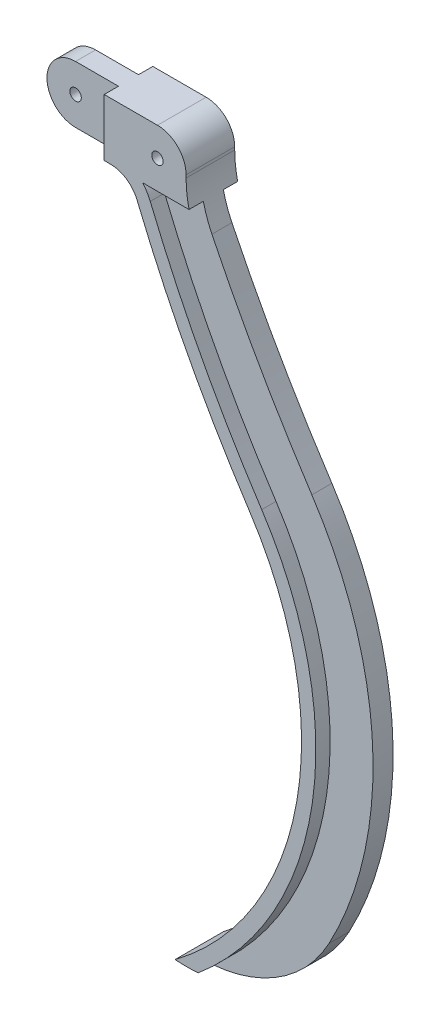
ISO-10303-21;
HEADER;
FILE_DESCRIPTION(('STEP AP214'),'2;1');
FILE_NAME('part.step','',(''),(''),'','','');
FILE_SCHEMA(('AUTOMOTIVE_DESIGN { 1 0 10303 214 1 1 1 1 }'));
ENDSEC;
DATA;
#1=APPLICATION_CONTEXT('core data for automotive mechanical design processes');
#2=APPLICATION_PROTOCOL_DEFINITION('international standard','automotive_design',2000,#1);
#3=PRODUCT_CONTEXT('',#1,'mechanical');
#4=PRODUCT('Part','Part','',(#3));
#5=PRODUCT_RELATED_PRODUCT_CATEGORY('part','',(#4));
#6=PRODUCT_DEFINITION_FORMATION('','',#4);
#7=PRODUCT_DEFINITION_CONTEXT('part definition',#1,'design');
#8=PRODUCT_DEFINITION('design','',#6,#7);
#9=PRODUCT_DEFINITION_SHAPE('','',#8);
#10=(LENGTH_UNIT() NAMED_UNIT(*) SI_UNIT(.MILLI.,.METRE.));
#11=(NAMED_UNIT(*) PLANE_ANGLE_UNIT() SI_UNIT($,.RADIAN.));
#12=(NAMED_UNIT(*) SI_UNIT($,.STERADIAN.) SOLID_ANGLE_UNIT());
#13=UNCERTAINTY_MEASURE_WITH_UNIT(LENGTH_MEASURE(1.E-05),#10,'distance_accuracy_value','');
#14=(GEOMETRIC_REPRESENTATION_CONTEXT(3) GLOBAL_UNCERTAINTY_ASSIGNED_CONTEXT((#13)) GLOBAL_UNIT_ASSIGNED_CONTEXT((#10,
#11,#12)) REPRESENTATION_CONTEXT('',''));
#15=CARTESIAN_POINT('',(0.,0.,0.));
#16=DIRECTION('',(0.,0.,1.));
#17=DIRECTION('',(1.,0.,0.));
#18=AXIS2_PLACEMENT_3D('',#15,#16,#17);
#19=CARTESIAN_POINT('',(26.0064078419205,151.361306160566,-8.));
#20=DIRECTION('',(0.,0.,1.));
#21=DIRECTION('',(1.,0.,0.));
#22=AXIS2_PLACEMENT_3D('',#19,#20,#21);
#23=CYLINDRICAL_SURFACE('',#22,9.99999999999999);
#24=DIRECTION('',(0.,0.,1.));
#25=VECTOR('',#24,1.);
#26=CARTESIAN_POINT('',(26.0064078419205,161.361306160566,-8.));
#27=LINE('',#26,#25);
#28=CARTESIAN_POINT('',(26.0064078419205,161.361306160566,0.));
#29=VERTEX_POINT('',#28);
#30=CARTESIAN_POINT('',(26.0064078419205,161.361306160566,7.));
#31=VERTEX_POINT('',#30);
#32=EDGE_CURVE('E62',#29,#31,#27,.T.);
#33=ORIENTED_EDGE('',*,*,#32,.F.);
#34=CARTESIAN_POINT('',(26.0064078419205,151.361306160566,0.));
#35=DIRECTION('',(0.,0.,-1.));
#36=DIRECTION('',(-1.,0.,0.));
#37=AXIS2_PLACEMENT_3D('',#34,#35,#36);
#38=CIRCLE('',#37,9.99999999999999);
#39=CARTESIAN_POINT('',(26.0064078419205,141.361306160566,0.));
#40=VERTEX_POINT('',#39);
#41=EDGE_CURVE('E214',#40,#29,#38,.T.);
#42=ORIENTED_EDGE('',*,*,#41,.F.);
#43=DIRECTION('',(0.,0.,1.));
#44=VECTOR('',#43,1.);
#45=CARTESIAN_POINT('',(26.0064078419205,141.361306160517,-8.));
#46=LINE('',#45,#44);
#47=CARTESIAN_POINT('',(26.0064078419205,141.361306160517,7.));
#48=VERTEX_POINT('',#47);
#49=EDGE_CURVE('E231',#40,#48,#46,.T.);
#50=ORIENTED_EDGE('',*,*,#49,.T.);
#51=CARTESIAN_POINT('',(26.0064078419205,151.361306160566,7.));
#52=DIRECTION('',(0.,0.,1.));
#53=DIRECTION('',(1.,0.,0.));
#54=AXIS2_PLACEMENT_3D('',#51,#52,#53);
#55=CIRCLE('',#54,9.99999999999999);
#56=EDGE_CURVE('E230',#31,#48,#55,.T.);
#57=ORIENTED_EDGE('',*,*,#56,.F.);
#58=EDGE_LOOP('',(#33,#42,#50,#57));
#59=FACE_BOUND('',#58,.T.);
#60=ADVANCED_FACE('F36',(#59),#23,.T.);
#61=CARTESIAN_POINT('',(0.,141.361306160566,-5.));
#62=DIRECTION('',(0.,1.,0.));
#63=DIRECTION('',(-1.,0.,0.));
#64=AXIS2_PLACEMENT_3D('',#61,#62,#63);
#65=PLANE('',#64);
#66=DIRECTION('',(-1.,0.,0.));
#67=VECTOR('',#66,1.);
#68=CARTESIAN_POINT('',(0.,141.361306160566,0.));
#69=LINE('',#68,#67);
#70=CARTESIAN_POINT('',(41.0064078419205,141.361306160566,0.));
#71=VERTEX_POINT('',#70);
#72=EDGE_CURVE('E219',#71,#40,#69,.T.);
#73=ORIENTED_EDGE('',*,*,#72,.F.);
#74=DIRECTION('',(0.,0.,-1.));
#75=VECTOR('',#74,1.);
#76=CARTESIAN_POINT('',(41.0064078419205,141.361306160566,0.));
#77=LINE('',#76,#75);
#78=CARTESIAN_POINT('',(41.0064078419205,141.361306160566,-5.));
#79=VERTEX_POINT('',#78);
#80=EDGE_CURVE('E463',#71,#79,#77,.T.);
#81=ORIENTED_EDGE('',*,*,#80,.T.);
#82=DIRECTION('',(-1.,0.,0.));
#83=VECTOR('',#82,1.);
#84=CARTESIAN_POINT('',(54.4167674366087,141.361306160566,-5.));
#85=LINE('',#84,#83);
#86=CARTESIAN_POINT('',(43.2364275491099,141.361306160566,-5.));
#87=VERTEX_POINT('',#86);
#88=EDGE_CURVE('E474',#87,#79,#85,.T.);
#89=ORIENTED_EDGE('',*,*,#88,.F.);
#90=DIRECTION('',(0.,0.,1.));
#91=VECTOR('',#90,1.);
#92=CARTESIAN_POINT('',(43.2364275491099,141.361306160566,-5.));
#93=LINE('',#92,#91);
#94=CARTESIAN_POINT('',(43.23642754911,141.361306160566,12.));
#95=VERTEX_POINT('',#94);
#96=EDGE_CURVE('E402',#87,#95,#93,.T.);
#97=ORIENTED_EDGE('',*,*,#96,.T.);
#98=DIRECTION('',(1.,1.09654838696025E-12,0.));
#99=VECTOR('',#98,1.);
#100=CARTESIAN_POINT('',(54.4167674366248,141.361306160549,12.));
#101=LINE('',#100,#99);
#102=CARTESIAN_POINT('',(41.0064078419205,141.361306160534,12.));
#103=VERTEX_POINT('',#102);
#104=EDGE_CURVE('E247',#103,#95,#101,.T.);
#105=ORIENTED_EDGE('',*,*,#104,.F.);
#106=DIRECTION('',(0.,0.,1.));
#107=VECTOR('',#106,1.);
#108=CARTESIAN_POINT('',(41.0064078419205,141.361306160534,7.));
#109=LINE('',#108,#107);
#110=CARTESIAN_POINT('',(41.0064078419205,141.361306160534,7.));
#111=VERTEX_POINT('',#110);
#112=EDGE_CURVE('E237',#111,#103,#109,.T.);
#113=ORIENTED_EDGE('',*,*,#112,.F.);
#114=DIRECTION('',(1.,1.09654838696025E-12,0.));
#115=VECTOR('',#114,1.);
#116=CARTESIAN_POINT('',(-1.55009512248878E-10,141.361306160489,7.));
#117=LINE('',#116,#115);
#118=EDGE_CURVE('E515',#48,#111,#117,.T.);
#119=ORIENTED_EDGE('',*,*,#118,.F.);
#120=ORIENTED_EDGE('',*,*,#49,.F.);
#121=EDGE_LOOP('',(#73,#81,#89,#97,#105,#113,#119,#120));
#122=FACE_BOUND('',#121,.T.);
#123=ADVANCED_FACE('F467',(#122),#65,.F.);
#124=CARTESIAN_POINT('',(0.,0.,12.));
#125=DIRECTION('',(0.,0.,1.));
#126=DIRECTION('',(1.,0.,0.));
#127=AXIS2_PLACEMENT_3D('',#124,#125,#126);
#128=PLANE('',#127);
#129=CARTESIAN_POINT('',(59.639031753599,151.361306160566,12.));
#130=DIRECTION('',(0.,0.,1.));
#131=DIRECTION('',(1.,0.,0.));
#132=AXIS2_PLACEMENT_3D('',#129,#130,#131);
#133=CIRCLE('',#132,2.);
#134=CARTESIAN_POINT('',(61.639031753599,151.361306160566,12.));
#135=VERTEX_POINT('',#134);
#136=EDGE_CURVE('E243',#135,#135,#133,.T.);
#137=ORIENTED_EDGE('',*,*,#136,.F.);
#138=EDGE_LOOP('',(#137));
#139=FACE_BOUND('',#138,.T.);
#140=DIRECTION('',(-1.,0.,0.));
#141=VECTOR('',#140,1.);
#142=CARTESIAN_POINT('',(0.,161.361306160566,12.));
#143=LINE('',#142,#141);
#144=CARTESIAN_POINT('',(59.639031753599,161.361306160566,12.));
#145=VERTEX_POINT('',#144);
#146=CARTESIAN_POINT('',(41.0064078419205,161.361306160566,12.));
#147=VERTEX_POINT('',#146);
#148=EDGE_CURVE('E259',#145,#147,#143,.T.);
#149=ORIENTED_EDGE('',*,*,#148,.T.);
#150=DIRECTION('',(0.,-1.,0.));
#151=VECTOR('',#150,1.);
#152=CARTESIAN_POINT('',(41.0064078419205,0.,12.));
#153=LINE('',#152,#151);
#154=EDGE_CURVE('E459',#147,#103,#153,.T.);
#155=ORIENTED_EDGE('',*,*,#154,.T.);
#156=ORIENTED_EDGE('',*,*,#104,.T.);
#157=CARTESIAN_POINT('',(43.23642754911,131.361306160566,12.));
#158=DIRECTION('',(0.,0.,1.));
#159=DIRECTION('',(1.,0.,0.));
#160=AXIS2_PLACEMENT_3D('',#157,#158,#159);
#161=CIRCLE('',#160,10.);
#162=CARTESIAN_POINT('',(52.4892579193839,135.154079570479,12.));
#163=VERTEX_POINT('',#162);
#164=EDGE_CURVE('E275',#95,#163,#161,.F.);
#165=ORIENTED_EDGE('',*,*,#164,.T.);
#166=CARTESIAN_POINT('',(458.278922904363,301.488940340937,12.));
#167=DIRECTION('',(0.,0.,1.));
#168=DIRECTION('',(1.,0.,0.));
#169=AXIS2_PLACEMENT_3D('',#166,#167,#168);
#170=CIRCLE('',#169,438.557337318793);
#171=CARTESIAN_POINT('',(91.8968320902866,60.4563665114739,12.));
#172=VERTEX_POINT('',#171);
#173=EDGE_CURVE('E278',#163,#172,#170,.T.);
#174=ORIENTED_EDGE('',*,*,#173,.T.);
#175=CARTESIAN_POINT('',(0.,0.,12.));
#176=DIRECTION('',(0.,0.,1.));
#177=DIRECTION('',(1.,0.,0.));
#178=AXIS2_PLACEMENT_3D('',#175,#176,#177);
#179=CIRCLE('',#178,110.);
#180=CARTESIAN_POINT('',(65.7870063524313,-88.1593432098104,12.));
#181=VERTEX_POINT('',#180);
#182=EDGE_CURVE('E281',#172,#181,#179,.F.);
#183=ORIENTED_EDGE('',*,*,#182,.T.);
#184=CARTESIAN_POINT('',(69.639031753599,-37.3081513309394,12.));
#185=DIRECTION('',(0.,0.,1.));
#186=DIRECTION('',(1.,0.,0.));
#187=AXIS2_PLACEMENT_3D('',#184,#185,#186);
#188=CIRCLE('',#187,50.9968804456998);
#189=CARTESIAN_POINT('',(73.8810042167599,-88.1282997448784,12.));
#190=VERTEX_POINT('',#189);
#191=EDGE_CURVE('E284',#181,#190,#188,.T.);
#192=ORIENTED_EDGE('',*,*,#191,.T.);
#193=CARTESIAN_POINT('',(0.,0.,12.));
#194=DIRECTION('',(0.,0.,1.));
#195=DIRECTION('',(1.,0.,0.));
#196=AXIS2_PLACEMENT_3D('',#193,#194,#195);
#197=CIRCLE('',#196,115.);
#198=CARTESIAN_POINT('',(96.0739608216634,63.2043831710868,12.));
#199=VERTEX_POINT('',#198);
#200=EDGE_CURVE('E286',#190,#199,#197,.T.);
#201=ORIENTED_EDGE('',*,*,#200,.T.);
#202=CARTESIAN_POINT('',(458.278922904363,301.488940340937,12.));
#203=DIRECTION('',(0.,0.,1.));
#204=DIRECTION('',(1.,0.,0.));
#205=AXIS2_PLACEMENT_3D('',#202,#203,#204);
#206=CIRCLE('',#205,433.557337318793);
#207=CARTESIAN_POINT('',(57.1156731045208,137.050466275435,12.));
#208=VERTEX_POINT('',#207);
#209=EDGE_CURVE('E268',#208,#199,#206,.T.);
#210=ORIENTED_EDGE('',*,*,#209,.F.);
#211=CARTESIAN_POINT('',(43.23642754911,131.361306160566,12.));
#212=DIRECTION('',(0.,0.,1.));
#213=DIRECTION('',(1.,0.,0.));
#214=AXIS2_PLACEMENT_3D('',#211,#212,#213);
#215=CIRCLE('',#214,15.);
#216=CARTESIAN_POINT('',(54.4167674366248,141.361306160549,12.));
#217=VERTEX_POINT('',#216);
#218=EDGE_CURVE('E271',#208,#217,#215,.T.);
#219=ORIENTED_EDGE('',*,*,#218,.T.);
#220=CARTESIAN_POINT('',(70.6669208791283,141.361306160566,12.));
#221=VERTEX_POINT('',#220);
#222=EDGE_CURVE('E250',#217,#221,#101,.T.);
#223=ORIENTED_EDGE('',*,*,#222,.T.);
#224=CARTESIAN_POINT('',(109.639031753603,150.370999495412,12.));
#225=DIRECTION('',(0.,0.,-1.));
#226=DIRECTION('',(-1.,0.,0.));
#227=AXIS2_PLACEMENT_3D('',#224,#225,#226);
#228=CIRCLE('',#227,40.0000000000042);
#229=CARTESIAN_POINT('',(69.639031753599,150.370999495412,12.));
#230=VERTEX_POINT('',#229);
#231=EDGE_CURVE('E249',#221,#230,#228,.T.);
#232=ORIENTED_EDGE('',*,*,#231,.T.);
#233=DIRECTION('',(0.,1.,0.));
#234=VECTOR('',#233,1.);
#235=CARTESIAN_POINT('',(69.639031753599,151.361306160566,12.));
#236=LINE('',#235,#234);
#237=CARTESIAN_POINT('',(69.639031753599,151.361306160566,12.));
#238=VERTEX_POINT('',#237);
#239=EDGE_CURVE('E253',#230,#238,#236,.T.);
#240=ORIENTED_EDGE('',*,*,#239,.T.);
#241=CARTESIAN_POINT('',(59.639031753599,151.361306160566,12.));
#242=DIRECTION('',(0.,0.,1.));
#243=DIRECTION('',(-1.,0.,0.));
#244=AXIS2_PLACEMENT_3D('',#241,#242,#243);
#245=CIRCLE('',#244,10.);
#246=EDGE_CURVE('E256',#238,#145,#245,.T.);
#247=ORIENTED_EDGE('',*,*,#246,.T.);
#248=EDGE_LOOP('',(#149,#155,#156,#165,#174,#183,#192,#201,#210,#219,#223,#232,#240,#247));
#249=FACE_BOUND('',#248,.T.);
#250=ADVANCED_FACE('F419',(#139,#249),#128,.T.);
#251=CARTESIAN_POINT('',(0.,161.361306160566,-5.));
#252=DIRECTION('',(0.,-1.,0.));
#253=DIRECTION('',(0.,0.,-1.));
#254=AXIS2_PLACEMENT_3D('',#251,#252,#253);
#255=PLANE('',#254);
#256=DIRECTION('',(1.,0.,0.));
#257=VECTOR('',#256,1.);
#258=CARTESIAN_POINT('',(0.,161.361306160566,-5.));
#259=LINE('',#258,#257);
#260=CARTESIAN_POINT('',(41.0064078419205,161.361306160566,-5.));
#261=VERTEX_POINT('',#260);
#262=CARTESIAN_POINT('',(59.639031753599,161.361306160566,-5.));
#263=VERTEX_POINT('',#262);
#264=EDGE_CURVE('E348',#261,#263,#259,.T.);
#265=ORIENTED_EDGE('',*,*,#264,.F.);
#266=DIRECTION('',(0.,0.,-1.));
#267=VECTOR('',#266,1.);
#268=CARTESIAN_POINT('',(41.0064078419205,161.361306160566,0.));
#269=LINE('',#268,#267);
#270=CARTESIAN_POINT('',(41.0064078419205,161.361306160566,0.));
#271=VERTEX_POINT('',#270);
#272=EDGE_CURVE('E54',#271,#261,#269,.T.);
#273=ORIENTED_EDGE('',*,*,#272,.F.);
#274=DIRECTION('',(1.,0.,0.));
#275=VECTOR('',#274,1.);
#276=CARTESIAN_POINT('',(0.,161.361306160566,0.));
#277=LINE('',#276,#275);
#278=EDGE_CURVE('E217',#29,#271,#277,.T.);
#279=ORIENTED_EDGE('',*,*,#278,.F.);
#280=ORIENTED_EDGE('',*,*,#32,.T.);
#281=DIRECTION('',(-1.,0.,0.));
#282=VECTOR('',#281,1.);
#283=CARTESIAN_POINT('',(0.,161.361306160566,7.));
#284=LINE('',#283,#282);
#285=CARTESIAN_POINT('',(41.0064078419205,161.361306160566,7.));
#286=VERTEX_POINT('',#285);
#287=EDGE_CURVE('E462',#286,#31,#284,.T.);
#288=ORIENTED_EDGE('',*,*,#287,.F.);
#289=DIRECTION('',(0.,0.,1.));
#290=VECTOR('',#289,1.);
#291=CARTESIAN_POINT('',(41.0064078419205,161.361306160566,7.));
#292=LINE('',#291,#290);
#293=EDGE_CURVE('E232',#286,#147,#292,.T.);
#294=ORIENTED_EDGE('',*,*,#293,.T.);
#295=ORIENTED_EDGE('',*,*,#148,.F.);
#296=DIRECTION('',(0.,0.,1.));
#297=VECTOR('',#296,1.);
#298=CARTESIAN_POINT('',(59.639031753599,161.361306160566,-5.));
#299=LINE('',#298,#297);
#300=EDGE_CURVE('E369',#263,#145,#299,.T.);
#301=ORIENTED_EDGE('',*,*,#300,.F.);
#302=EDGE_LOOP('',(#265,#273,#279,#280,#288,#294,#295,#301));
#303=FACE_BOUND('',#302,.T.);
#304=ADVANCED_FACE('F225',(#303),#255,.F.);
#305=CARTESIAN_POINT('',(0.,0.,-5.));
#306=DIRECTION('',(0.,0.,-1.));
#307=DIRECTION('',(-1.,0.,0.));
#308=AXIS2_PLACEMENT_3D('',#305,#306,#307);
#309=PLANE('',#308);
#310=DIRECTION('',(0.,-1.,0.));
#311=VECTOR('',#310,1.);
#312=CARTESIAN_POINT('',(41.0064078419205,0.,-5.));
#313=LINE('',#312,#311);
#314=EDGE_CURVE('E222',#261,#79,#313,.T.);
#315=ORIENTED_EDGE('',*,*,#314,.F.);
#316=ORIENTED_EDGE('',*,*,#264,.T.);
#317=CARTESIAN_POINT('',(59.639031753599,151.361306160566,-5.));
#318=DIRECTION('',(0.,0.,-1.));
#319=DIRECTION('',(-1.,0.,0.));
#320=AXIS2_PLACEMENT_3D('',#317,#318,#319);
#321=CIRCLE('',#320,10.0000000000001);
#322=CARTESIAN_POINT('',(69.639031753599,151.361306160566,-5.));
#323=VERTEX_POINT('',#322);
#324=EDGE_CURVE('E353',#263,#323,#321,.T.);
#325=ORIENTED_EDGE('',*,*,#324,.T.);
#326=DIRECTION('',(-2.38231651905707E-13,-1.,0.));
#327=VECTOR('',#326,1.);
#328=CARTESIAN_POINT('',(69.639031753599,151.361306160566,-5.));
#329=LINE('',#328,#327);
#330=CARTESIAN_POINT('',(69.6390317535988,150.370999495412,-5.));
#331=VERTEX_POINT('',#330);
#332=EDGE_CURVE('E450',#323,#331,#329,.T.);
#333=ORIENTED_EDGE('',*,*,#332,.T.);
#334=CARTESIAN_POINT('',(109.639031753603,150.370999495413,-5.));
#335=DIRECTION('',(0.,0.,1.));
#336=DIRECTION('',(1.,0.,0.));
#337=AXIS2_PLACEMENT_3D('',#334,#335,#336);
#338=CIRCLE('',#337,40.0000000000041);
#339=CARTESIAN_POINT('',(70.6669208791282,141.361306160566,-5.));
#340=VERTEX_POINT('',#339);
#341=EDGE_CURVE('E446',#331,#340,#338,.T.);
#342=ORIENTED_EDGE('',*,*,#341,.T.);
#343=CARTESIAN_POINT('',(54.4167674366087,141.361306160566,-5.));
#344=VERTEX_POINT('',#343);
#345=EDGE_CURVE('E363',#340,#344,#85,.T.);
#346=ORIENTED_EDGE('',*,*,#345,.T.);
#347=CARTESIAN_POINT('',(43.23642754911,131.361306160566,-5.));
#348=DIRECTION('',(0.,0.,-1.));
#349=DIRECTION('',(-1.,0.,0.));
#350=AXIS2_PLACEMENT_3D('',#347,#348,#349);
#351=CIRCLE('',#350,14.9999999999998);
#352=CARTESIAN_POINT('',(57.1156731045207,137.050466275434,-5.));
#353=VERTEX_POINT('',#352);
#354=EDGE_CURVE('E383',#344,#353,#351,.T.);
#355=ORIENTED_EDGE('',*,*,#354,.T.);
#356=CARTESIAN_POINT('',(458.278922904363,301.488940340937,-5.));
#357=DIRECTION('',(0.,0.,1.));
#358=DIRECTION('',(-1.,0.,0.));
#359=AXIS2_PLACEMENT_3D('',#356,#357,#358);
#360=CIRCLE('',#359,433.557337318793);
#361=CARTESIAN_POINT('',(96.0739608216634,63.2043831710864,-5.));
#362=VERTEX_POINT('',#361);
#363=EDGE_CURVE('E385',#353,#362,#360,.T.);
#364=ORIENTED_EDGE('',*,*,#363,.T.);
#365=CARTESIAN_POINT('',(0.,0.,-5.));
#366=DIRECTION('',(0.,0.,-1.));
#367=DIRECTION('',(-1.,0.,0.));
#368=AXIS2_PLACEMENT_3D('',#365,#366,#367);
#369=CIRCLE('',#368,115.);
#370=CARTESIAN_POINT('',(73.88100421676,-88.1282997448784,-5.));
#371=VERTEX_POINT('',#370);
#372=EDGE_CURVE('E371',#362,#371,#369,.T.);
#373=ORIENTED_EDGE('',*,*,#372,.T.);
#374=CARTESIAN_POINT('',(69.6390317535986,-37.3081513308979,-5.));
#375=DIRECTION('',(0.,0.,-1.));
#376=DIRECTION('',(-1.,0.,0.));
#377=AXIS2_PLACEMENT_3D('',#374,#375,#376);
#378=CIRCLE('',#377,50.9968804457412);
#379=CARTESIAN_POINT('',(65.7870063524313,-88.1593432098105,-5.));
#380=VERTEX_POINT('',#379);
#381=EDGE_CURVE('E374',#371,#380,#378,.T.);
#382=ORIENTED_EDGE('',*,*,#381,.T.);
#383=CARTESIAN_POINT('',(-5.41233724504764E-13,0.,-5.));
#384=DIRECTION('',(0.,0.,1.));
#385=DIRECTION('',(1.,0.,0.));
#386=AXIS2_PLACEMENT_3D('',#383,#384,#385);
#387=CIRCLE('',#386,110.);
#388=CARTESIAN_POINT('',(91.8968320902867,60.4563665114738,-5.));
#389=VERTEX_POINT('',#388);
#390=EDGE_CURVE('E377',#380,#389,#387,.T.);
#391=ORIENTED_EDGE('',*,*,#390,.T.);
#392=CARTESIAN_POINT('',(458.278922904402,301.488940340956,-5.));
#393=DIRECTION('',(0.,0.,-1.));
#394=DIRECTION('',(1.,0.,0.));
#395=AXIS2_PLACEMENT_3D('',#392,#393,#394);
#396=CIRCLE('',#395,438.557337318836);
#397=CARTESIAN_POINT('',(52.4892579193839,135.154079570479,-5.));
#398=VERTEX_POINT('',#397);
#399=EDGE_CURVE('E379',#389,#398,#396,.T.);
#400=ORIENTED_EDGE('',*,*,#399,.T.);
#401=CARTESIAN_POINT('',(43.2364275491099,131.361306160566,-5.));
#402=DIRECTION('',(0.,0.,1.));
#403=DIRECTION('',(-1.,0.,0.));
#404=AXIS2_PLACEMENT_3D('',#401,#402,#403);
#405=CIRCLE('',#404,10.0000000000002);
#406=EDGE_CURVE('E381',#398,#87,#405,.T.);
#407=ORIENTED_EDGE('',*,*,#406,.T.);
#408=ORIENTED_EDGE('',*,*,#88,.T.);
#409=EDGE_LOOP('',(#315,#316,#325,#333,#342,#346,#355,#364,#373,#382,#391,#400,#407,#408));
#410=FACE_BOUND('',#409,.T.);
#411=CARTESIAN_POINT('',(59.639031753599,151.361306160566,-5.));
#412=DIRECTION('',(0.,0.,-1.));
#413=DIRECTION('',(-1.,0.,0.));
#414=AXIS2_PLACEMENT_3D('',#411,#412,#413);
#415=CIRCLE('',#414,2.);
#416=CARTESIAN_POINT('',(57.639031753599,151.361306160566,-5.));
#417=VERTEX_POINT('',#416);
#418=EDGE_CURVE('E234',#417,#417,#415,.T.);
#419=ORIENTED_EDGE('',*,*,#418,.F.);
#420=EDGE_LOOP('',(#419));
#421=FACE_BOUND('',#420,.T.);
#422=ADVANCED_FACE('F481',(#410,#421),#309,.T.);
#423=CARTESIAN_POINT('',(0.,0.,-5.));
#424=DIRECTION('',(0.,0.,1.));
#425=DIRECTION('',(1.,0.,0.));
#426=AXIS2_PLACEMENT_3D('',#423,#424,#425);
#427=CYLINDRICAL_SURFACE('',#426,115.);
#428=CARTESIAN_POINT('',(0.,0.,0.));
#429=DIRECTION('',(0.,0.,-1.));
#430=DIRECTION('',(-1.,0.,0.));
#431=AXIS2_PLACEMENT_3D('',#428,#429,#430);
#432=CIRCLE('',#431,115.);
#433=CARTESIAN_POINT('',(96.0739608216634,63.2043831710864,0.));
#434=VERTEX_POINT('',#433);
#435=CARTESIAN_POINT('',(73.8810042167598,-88.1282997448784,0.));
#436=VERTEX_POINT('',#435);
#437=EDGE_CURVE('E40',#434,#436,#432,.T.);
#438=ORIENTED_EDGE('',*,*,#437,.T.);
#439=DIRECTION('',(0.,0.,1.));
#440=VECTOR('',#439,1.);
#441=CARTESIAN_POINT('',(73.88100421676,-88.1282997448784,-5.));
#442=LINE('',#441,#440);
#443=EDGE_CURVE('E11',#371,#436,#442,.T.);
#444=ORIENTED_EDGE('',*,*,#443,.F.);
#445=ORIENTED_EDGE('',*,*,#372,.F.);
#446=DIRECTION('',(0.,0.,1.));
#447=VECTOR('',#446,1.);
#448=CARTESIAN_POINT('',(96.0739608216634,63.2043831710864,-5.));
#449=LINE('',#448,#447);
#450=EDGE_CURVE('E386',#362,#434,#449,.T.);
#451=ORIENTED_EDGE('',*,*,#450,.T.);
#452=EDGE_LOOP('',(#438,#444,#445,#451));
#453=FACE_BOUND('',#452,.T.);
#454=ADVANCED_FACE('F38',(#453),#427,.T.);
#455=CARTESIAN_POINT('',(69.6390317535986,-37.3081513308979,-5.));
#456=DIRECTION('',(0.,0.,1.));
#457=DIRECTION('',(1.,0.,0.));
#458=AXIS2_PLACEMENT_3D('',#455,#456,#457);
#459=CYLINDRICAL_SURFACE('',#458,50.9968804457412);
#460=ORIENTED_EDGE('',*,*,#443,.T.);
#461=CARTESIAN_POINT('',(69.639031753599,-37.3081513309394,0.));
#462=DIRECTION('',(0.,0.,1.));
#463=DIRECTION('',(-1.,0.,0.));
#464=AXIS2_PLACEMENT_3D('',#461,#462,#463);
#465=CIRCLE('',#464,50.9968804456998);
#466=CARTESIAN_POINT('',(114.591350051001,-61.3907362188222,0.));
#467=VERTEX_POINT('',#466);
#468=EDGE_CURVE('E302',#436,#467,#465,.T.);
#469=ORIENTED_EDGE('',*,*,#468,.T.);
#470=DIRECTION('',(0.,0.,-1.));
#471=VECTOR('',#470,1.);
#472=CARTESIAN_POINT('',(114.591350051001,-61.3907362188222,7.));
#473=LINE('',#472,#471);
#474=CARTESIAN_POINT('',(114.591350051001,-61.3907362188222,7.));
#475=VERTEX_POINT('',#474);
#476=EDGE_CURVE('E312',#475,#467,#473,.T.);
#477=ORIENTED_EDGE('',*,*,#476,.F.);
#478=CARTESIAN_POINT('',(69.639031753599,-37.3081513309394,7.));
#479=DIRECTION('',(0.,0.,1.));
#480=DIRECTION('',(-1.,0.,0.));
#481=AXIS2_PLACEMENT_3D('',#478,#479,#480);
#482=CIRCLE('',#481,50.9968804456998);
#483=CARTESIAN_POINT('',(73.88100421676,-88.1282997448784,7.));
#484=VERTEX_POINT('',#483);
#485=EDGE_CURVE('E308',#484,#475,#482,.T.);
#486=ORIENTED_EDGE('',*,*,#485,.F.);
#487=DIRECTION('',(0.,0.,-1.));
#488=VECTOR('',#487,1.);
#489=CARTESIAN_POINT('',(73.8810042167599,-88.1282997448784,12.));
#490=LINE('',#489,#488);
#491=EDGE_CURVE('E295',#190,#484,#490,.T.);
#492=ORIENTED_EDGE('',*,*,#491,.F.);
#493=ORIENTED_EDGE('',*,*,#191,.F.);
#494=DIRECTION('',(0.,0.,1.));
#495=VECTOR('',#494,1.);
#496=CARTESIAN_POINT('',(65.7870063524313,-88.1593432098105,-5.));
#497=LINE('',#496,#495);
#498=EDGE_CURVE('E46',#380,#181,#497,.T.);
#499=ORIENTED_EDGE('',*,*,#498,.F.);
#500=ORIENTED_EDGE('',*,*,#381,.F.);
#501=EDGE_LOOP('',(#460,#469,#477,#486,#492,#493,#499,#500));
#502=FACE_BOUND('',#501,.T.);
#503=ADVANCED_FACE('F421',(#502),#459,.T.);
#504=CARTESIAN_POINT('',(-5.41233724504764E-13,0.,-5.));
#505=DIRECTION('',(0.,0.,1.));
#506=DIRECTION('',(1.,0.,0.));
#507=AXIS2_PLACEMENT_3D('',#504,#505,#506);
#508=CYLINDRICAL_SURFACE('',#507,110.);
#509=ORIENTED_EDGE('',*,*,#498,.T.);
#510=ORIENTED_EDGE('',*,*,#182,.F.);
#511=DIRECTION('',(0.,0.,1.));
#512=VECTOR('',#511,1.);
#513=CARTESIAN_POINT('',(91.8968320902867,60.4563665114738,-5.));
#514=LINE('',#513,#512);
#515=EDGE_CURVE('E406',#389,#172,#514,.T.);
#516=ORIENTED_EDGE('',*,*,#515,.F.);
#517=ORIENTED_EDGE('',*,*,#390,.F.);
#518=EDGE_LOOP('',(#509,#510,#516,#517));
#519=FACE_BOUND('',#518,.T.);
#520=ADVANCED_FACE('F415',(#519),#508,.F.);
#521=CARTESIAN_POINT('',(458.278922904402,301.488940340956,-5.));
#522=DIRECTION('',(0.,0.,1.));
#523=DIRECTION('',(1.,0.,0.));
#524=AXIS2_PLACEMENT_3D('',#521,#522,#523);
#525=CYLINDRICAL_SURFACE('',#524,438.557337318836);
#526=ORIENTED_EDGE('',*,*,#515,.T.);
#527=ORIENTED_EDGE('',*,*,#173,.F.);
#528=DIRECTION('',(0.,0.,1.));
#529=VECTOR('',#528,1.);
#530=CARTESIAN_POINT('',(52.4892579193839,135.154079570479,-5.));
#531=LINE('',#530,#529);
#532=EDGE_CURVE('E405',#398,#163,#531,.T.);
#533=ORIENTED_EDGE('',*,*,#532,.F.);
#534=ORIENTED_EDGE('',*,*,#399,.F.);
#535=EDGE_LOOP('',(#526,#527,#533,#534));
#536=FACE_BOUND('',#535,.T.);
#537=ADVANCED_FACE('F479',(#536),#525,.T.);
#538=CARTESIAN_POINT('',(43.2364275491099,131.361306160566,-5.));
#539=DIRECTION('',(0.,0.,1.));
#540=DIRECTION('',(1.,0.,0.));
#541=AXIS2_PLACEMENT_3D('',#538,#539,#540);
#542=CYLINDRICAL_SURFACE('',#541,10.0000000000002);
#543=ORIENTED_EDGE('',*,*,#532,.T.);
#544=ORIENTED_EDGE('',*,*,#164,.F.);
#545=ORIENTED_EDGE('',*,*,#96,.F.);
#546=ORIENTED_EDGE('',*,*,#406,.F.);
#547=EDGE_LOOP('',(#543,#544,#545,#546));
#548=FACE_BOUND('',#547,.T.);
#549=ADVANCED_FACE('F477',(#548),#542,.F.);
#550=CARTESIAN_POINT('',(43.23642754911,131.361306160566,-5.));
#551=DIRECTION('',(0.,0.,1.));
#552=DIRECTION('',(1.,0.,0.));
#553=AXIS2_PLACEMENT_3D('',#550,#551,#552);
#554=CYLINDRICAL_SURFACE('',#553,14.9999999999998);
#555=CARTESIAN_POINT('',(43.23642754911,131.361306160566,0.));
#556=DIRECTION('',(0.,0.,-1.));
#557=DIRECTION('',(-1.,0.,0.));
#558=AXIS2_PLACEMENT_3D('',#555,#556,#557);
#559=CIRCLE('',#558,14.9999999999998);
#560=CARTESIAN_POINT('',(54.4167674366087,141.361306160566,0.));
#561=VERTEX_POINT('',#560);
#562=CARTESIAN_POINT('',(57.1156731045207,137.050466275434,0.));
#563=VERTEX_POINT('',#562);
#564=EDGE_CURVE('E389',#561,#563,#559,.T.);
#565=ORIENTED_EDGE('',*,*,#564,.T.);
#566=DIRECTION('',(0.,0.,1.));
#567=VECTOR('',#566,1.);
#568=CARTESIAN_POINT('',(57.1156731045207,137.050466275434,-5.));
#569=LINE('',#568,#567);
#570=EDGE_CURVE('E396',#353,#563,#569,.T.);
#571=ORIENTED_EDGE('',*,*,#570,.F.);
#572=ORIENTED_EDGE('',*,*,#354,.F.);
#573=DIRECTION('',(0.,0.,1.));
#574=VECTOR('',#573,1.);
#575=CARTESIAN_POINT('',(54.4167674366087,141.361306160566,-5.));
#576=LINE('',#575,#574);
#577=EDGE_CURVE('E399',#344,#561,#576,.T.);
#578=ORIENTED_EDGE('',*,*,#577,.T.);
#579=EDGE_LOOP('',(#565,#571,#572,#578));
#580=FACE_BOUND('',#579,.T.);
#581=ADVANCED_FACE('F495',(#580),#554,.T.);
#582=CARTESIAN_POINT('',(458.278922904363,301.488940340937,-5.));
#583=DIRECTION('',(0.,0.,1.));
#584=DIRECTION('',(1.,0.,0.));
#585=AXIS2_PLACEMENT_3D('',#582,#583,#584);
#586=CYLINDRICAL_SURFACE('',#585,433.557337318793);
#587=CARTESIAN_POINT('',(458.278922904363,301.488940340937,0.));
#588=DIRECTION('',(0.,0.,1.));
#589=DIRECTION('',(-1.,0.,0.));
#590=AXIS2_PLACEMENT_3D('',#587,#588,#589);
#591=CIRCLE('',#590,433.557337318793);
#592=EDGE_CURVE('E375',#563,#434,#591,.T.);
#593=ORIENTED_EDGE('',*,*,#592,.T.);
#594=ORIENTED_EDGE('',*,*,#450,.F.);
#595=ORIENTED_EDGE('',*,*,#363,.F.);
#596=ORIENTED_EDGE('',*,*,#570,.T.);
#597=EDGE_LOOP('',(#593,#594,#595,#596));
#598=FACE_BOUND('',#597,.T.);
#599=ADVANCED_FACE('F491',(#598),#586,.F.);
#600=DIRECTION('',(-1.,0.,0.));
#601=VECTOR('',#600,1.);
#602=CARTESIAN_POINT('',(0.,141.361306160566,0.));
#603=LINE('',#602,#601);
#604=CARTESIAN_POINT('',(70.6669208791284,141.361306160566,0.));
#605=VERTEX_POINT('',#604);
#606=EDGE_CURVE('E342',#605,#561,#603,.T.);
#607=ORIENTED_EDGE('',*,*,#606,.T.);
#608=ORIENTED_EDGE('',*,*,#577,.F.);
#609=ORIENTED_EDGE('',*,*,#345,.F.);
#610=DIRECTION('',(0.,0.,1.));
#611=VECTOR('',#610,1.);
#612=CARTESIAN_POINT('',(70.6669208791282,141.361306160566,-5.));
#613=LINE('',#612,#611);
#614=EDGE_CURVE('E358',#340,#605,#613,.T.);
#615=ORIENTED_EDGE('',*,*,#614,.T.);
#616=EDGE_LOOP('',(#607,#608,#609,#615));
#617=FACE_BOUND('',#616,.T.);
#618=ADVANCED_FACE('F499',(#617),#65,.F.);
#619=CARTESIAN_POINT('',(59.639031753599,151.361306160566,-5.));
#620=DIRECTION('',(0.,0.,1.));
#621=DIRECTION('',(1.,0.,0.));
#622=AXIS2_PLACEMENT_3D('',#619,#620,#621);
#623=CYLINDRICAL_SURFACE('',#622,10.0000000000001);
#624=ORIENTED_EDGE('',*,*,#300,.T.);
#625=ORIENTED_EDGE('',*,*,#246,.F.);
#626=DIRECTION('',(0.,0.,1.));
#627=VECTOR('',#626,1.);
#628=CARTESIAN_POINT('',(69.639031753599,151.361306160566,-5.));
#629=LINE('',#628,#627);
#630=EDGE_CURVE('E367',#323,#238,#629,.T.);
#631=ORIENTED_EDGE('',*,*,#630,.F.);
#632=ORIENTED_EDGE('',*,*,#324,.F.);
#633=EDGE_LOOP('',(#624,#625,#631,#632));
#634=FACE_BOUND('',#633,.T.);
#635=ADVANCED_FACE('F455',(#634),#623,.T.);
#636=CARTESIAN_POINT('',(69.639031753599,151.361306160566,-5.));
#637=DIRECTION('',(-1.,2.38231651905707E-13,0.));
#638=DIRECTION('',(-2.38231651905707E-13,-1.,0.));
#639=AXIS2_PLACEMENT_3D('',#636,#637,#638);
#640=PLANE('',#639);
#641=ORIENTED_EDGE('',*,*,#630,.T.);
#642=ORIENTED_EDGE('',*,*,#239,.F.);
#643=DIRECTION('',(0.,0.,1.));
#644=VECTOR('',#643,1.);
#645=CARTESIAN_POINT('',(69.6390317535988,150.370999495412,-5.));
#646=LINE('',#645,#644);
#647=EDGE_CURVE('E365',#331,#230,#646,.T.);
#648=ORIENTED_EDGE('',*,*,#647,.F.);
#649=ORIENTED_EDGE('',*,*,#332,.F.);
#650=EDGE_LOOP('',(#641,#642,#648,#649));
#651=FACE_BOUND('',#650,.T.);
#652=ADVANCED_FACE('F449',(#651),#640,.F.);
#653=CARTESIAN_POINT('',(109.639031753603,150.370999495413,-5.));
#654=DIRECTION('',(0.,0.,1.));
#655=DIRECTION('',(1.,0.,0.));
#656=AXIS2_PLACEMENT_3D('',#653,#654,#655);
#657=CYLINDRICAL_SURFACE('',#656,40.0000000000041);
#658=ORIENTED_EDGE('',*,*,#647,.T.);
#659=ORIENTED_EDGE('',*,*,#231,.F.);
#660=DIRECTION('',(0.,0.,-1.));
#661=VECTOR('',#660,1.);
#662=CARTESIAN_POINT('',(70.6669208791283,141.361306160566,12.));
#663=LINE('',#662,#661);
#664=CARTESIAN_POINT('',(70.6669208791284,141.361306160566,7.));
#665=VERTEX_POINT('',#664);
#666=EDGE_CURVE('E262',#221,#665,#663,.T.);
#667=ORIENTED_EDGE('',*,*,#666,.T.);
#668=CARTESIAN_POINT('',(109.639031753599,150.370999495412,7.));
#669=DIRECTION('',(0.,0.,-1.));
#670=DIRECTION('',(-1.,0.,0.));
#671=AXIS2_PLACEMENT_3D('',#668,#669,#670);
#672=CIRCLE('',#671,40.);
#673=CARTESIAN_POINT('',(73.6621239930726,132.887804478751,7.));
#674=VERTEX_POINT('',#673);
#675=EDGE_CURVE('E335',#674,#665,#672,.T.);
#676=ORIENTED_EDGE('',*,*,#675,.F.);
#677=DIRECTION('',(0.,0.,-1.));
#678=VECTOR('',#677,1.);
#679=CARTESIAN_POINT('',(73.6621239930726,132.887804478751,7.));
#680=LINE('',#679,#678);
#681=CARTESIAN_POINT('',(73.6621239930726,132.887804478751,0.));
#682=VERTEX_POINT('',#681);
#683=EDGE_CURVE('E332',#674,#682,#680,.T.);
#684=ORIENTED_EDGE('',*,*,#683,.T.);
#685=CARTESIAN_POINT('',(109.639031753599,150.370999495412,0.));
#686=DIRECTION('',(0.,0.,-1.));
#687=DIRECTION('',(-1.,0.,0.));
#688=AXIS2_PLACEMENT_3D('',#685,#686,#687);
#689=CIRCLE('',#688,40.);
#690=EDGE_CURVE('E311',#682,#605,#689,.T.);
#691=ORIENTED_EDGE('',*,*,#690,.T.);
#692=ORIENTED_EDGE('',*,*,#614,.F.);
#693=ORIENTED_EDGE('',*,*,#341,.F.);
#694=EDGE_LOOP('',(#658,#659,#667,#676,#684,#691,#692,#693));
#695=FACE_BOUND('',#694,.T.);
#696=ADVANCED_FACE('F441',(#695),#657,.F.);
#697=CARTESIAN_POINT('',(458.278922904363,301.488940340937,0.));
#698=DIRECTION('',(0.,0.,-1.));
#699=DIRECTION('',(-1.,0.,0.));
#700=AXIS2_PLACEMENT_3D('',#697,#698,#699);
#701=PLANE('',#700);
#702=ORIENTED_EDGE('',*,*,#437,.F.);
#703=ORIENTED_EDGE('',*,*,#592,.F.);
#704=ORIENTED_EDGE('',*,*,#564,.F.);
#705=ORIENTED_EDGE('',*,*,#606,.F.);
#706=ORIENTED_EDGE('',*,*,#690,.F.);
#707=CARTESIAN_POINT('',(564.759416903904,371.539491868485,0.));
#708=DIRECTION('',(0.,0.,-1.));
#709=DIRECTION('',(-1.,0.,0.));
#710=AXIS2_PLACEMENT_3D('',#707,#708,#709);
#711=CIRCLE('',#710,546.013900004674);
#712=CARTESIAN_POINT('',(108.605347015793,71.4484331499235,0.));
#713=VERTEX_POINT('',#712);
#714=EDGE_CURVE('E325',#713,#682,#711,.T.);
#715=ORIENTED_EDGE('',*,*,#714,.F.);
#716=CARTESIAN_POINT('',(0.,0.,0.));
#717=DIRECTION('',(0.,0.,1.));
#718=DIRECTION('',(1.,0.,0.));
#719=AXIS2_PLACEMENT_3D('',#716,#717,#718);
#720=CIRCLE('',#719,130.);
#721=EDGE_CURVE('E876',#467,#713,#720,.T.);
#722=ORIENTED_EDGE('',*,*,#721,.F.);
#723=ORIENTED_EDGE('',*,*,#468,.F.);
#724=EDGE_LOOP('',(#702,#703,#704,#705,#706,#715,#722,#723));
#725=FACE_BOUND('',#724,.T.);
#726=ADVANCED_FACE('F489',(#725),#701,.T.);
#727=CARTESIAN_POINT('',(458.278922904363,301.488940340937,7.));
#728=DIRECTION('',(0.,0.,-1.));
#729=DIRECTION('',(-1.,0.,0.));
#730=AXIS2_PLACEMENT_3D('',#727,#728,#729);
#731=PLANE('',#730);
#732=DIRECTION('',(1.,-3.2796573485616E-13,0.));
#733=VECTOR('',#732,1.);
#734=CARTESIAN_POINT('',(54.4167674366248,141.361306160549,7.));
#735=LINE('',#734,#733);
#736=CARTESIAN_POINT('',(54.4167674366248,141.361306160549,7.));
#737=VERTEX_POINT('',#736);
#738=EDGE_CURVE('E246',#737,#665,#735,.T.);
#739=ORIENTED_EDGE('',*,*,#738,.F.);
#740=CARTESIAN_POINT('',(43.23642754911,131.361306160566,7.));
#741=DIRECTION('',(0.,0.,1.));
#742=DIRECTION('',(1.,0.,0.));
#743=AXIS2_PLACEMENT_3D('',#740,#741,#742);
#744=CIRCLE('',#743,15.);
#745=CARTESIAN_POINT('',(57.1156731045208,137.050466275435,7.));
#746=VERTEX_POINT('',#745);
#747=EDGE_CURVE('E290',#746,#737,#744,.T.);
#748=ORIENTED_EDGE('',*,*,#747,.F.);
#749=CARTESIAN_POINT('',(458.278922904363,301.488940340937,7.));
#750=DIRECTION('',(0.,0.,1.));
#751=DIRECTION('',(1.,0.,0.));
#752=AXIS2_PLACEMENT_3D('',#749,#750,#751);
#753=CIRCLE('',#752,433.557337318793);
#754=CARTESIAN_POINT('',(96.0739608216634,63.2043831710868,7.));
#755=VERTEX_POINT('',#754);
#756=EDGE_CURVE('E267',#746,#755,#753,.T.);
#757=ORIENTED_EDGE('',*,*,#756,.T.);
#758=CARTESIAN_POINT('',(0.,0.,7.));
#759=DIRECTION('',(0.,0.,1.));
#760=DIRECTION('',(1.,0.,0.));
#761=AXIS2_PLACEMENT_3D('',#758,#759,#760);
#762=CIRCLE('',#761,115.);
#763=EDGE_CURVE('E272',#484,#755,#762,.T.);
#764=ORIENTED_EDGE('',*,*,#763,.F.);
#765=ORIENTED_EDGE('',*,*,#485,.T.);
#766=CARTESIAN_POINT('',(0.,0.,7.));
#767=DIRECTION('',(0.,0.,1.));
#768=DIRECTION('',(1.,0.,0.));
#769=AXIS2_PLACEMENT_3D('',#766,#767,#768);
#770=CIRCLE('',#769,130.);
#771=CARTESIAN_POINT('',(108.605347015793,71.4484331499235,7.));
#772=VERTEX_POINT('',#771);
#773=EDGE_CURVE('E305',#475,#772,#770,.T.);
#774=ORIENTED_EDGE('',*,*,#773,.T.);
#775=CARTESIAN_POINT('',(564.759416903904,371.539491868485,7.));
#776=DIRECTION('',(0.,0.,-1.));
#777=DIRECTION('',(-1.,0.,0.));
#778=AXIS2_PLACEMENT_3D('',#775,#776,#777);
#779=CIRCLE('',#778,546.013900004674);
#780=EDGE_CURVE('E879',#772,#674,#779,.T.);
#781=ORIENTED_EDGE('',*,*,#780,.T.);
#782=ORIENTED_EDGE('',*,*,#675,.T.);
#783=EDGE_LOOP('',(#739,#748,#757,#764,#765,#774,#781,#782));
#784=FACE_BOUND('',#783,.T.);
#785=ADVANCED_FACE('F564',(#784),#731,.F.);
#786=CARTESIAN_POINT('',(0.,0.,7.));
#787=DIRECTION('',(0.,0.,-1.));
#788=DIRECTION('',(-1.,0.,0.));
#789=AXIS2_PLACEMENT_3D('',#786,#787,#788);
#790=CYLINDRICAL_SURFACE('',#789,130.);
#791=ORIENTED_EDGE('',*,*,#721,.T.);
#792=DIRECTION('',(0.,0.,-1.));
#793=VECTOR('',#792,1.);
#794=CARTESIAN_POINT('',(108.605347015793,71.4484331499235,7.));
#795=LINE('',#794,#793);
#796=EDGE_CURVE('E334',#772,#713,#795,.T.);
#797=ORIENTED_EDGE('',*,*,#796,.F.);
#798=ORIENTED_EDGE('',*,*,#773,.F.);
#799=ORIENTED_EDGE('',*,*,#476,.T.);
#800=EDGE_LOOP('',(#791,#797,#798,#799));
#801=FACE_BOUND('',#800,.T.);
#802=ADVANCED_FACE('F567',(#801),#790,.T.);
#803=CARTESIAN_POINT('',(564.759416903904,371.539491868485,7.));
#804=DIRECTION('',(0.,0.,-1.));
#805=DIRECTION('',(-1.,0.,0.));
#806=AXIS2_PLACEMENT_3D('',#803,#804,#805);
#807=CYLINDRICAL_SURFACE('',#806,546.013900004674);
#808=ORIENTED_EDGE('',*,*,#714,.T.);
#809=ORIENTED_EDGE('',*,*,#683,.F.);
#810=ORIENTED_EDGE('',*,*,#780,.F.);
#811=ORIENTED_EDGE('',*,*,#796,.T.);
#812=EDGE_LOOP('',(#808,#809,#810,#811));
#813=FACE_BOUND('',#812,.T.);
#814=ADVANCED_FACE('F562',(#813),#807,.F.);
#815=CARTESIAN_POINT('',(59.639031753599,151.361306160566,7.));
#816=DIRECTION('',(0.,0.,-1.));
#817=DIRECTION('',(-1.,0.,0.));
#818=AXIS2_PLACEMENT_3D('',#815,#816,#817);
#819=CYLINDRICAL_SURFACE('',#818,2.);
#820=ORIENTED_EDGE('',*,*,#136,.T.);
#821=EDGE_LOOP('',(#820));
#822=FACE_BOUND('',#821,.T.);
#823=ORIENTED_EDGE('',*,*,#418,.T.);
#824=EDGE_LOOP('',(#823));
#825=FACE_BOUND('',#824,.T.);
#826=ADVANCED_FACE('F559',(#822,#825),#819,.F.);
#827=CARTESIAN_POINT('',(458.278922904363,301.488940340937,12.));
#828=DIRECTION('',(0.,0.,-1.));
#829=DIRECTION('',(-1.,0.,0.));
#830=AXIS2_PLACEMENT_3D('',#827,#828,#829);
#831=CYLINDRICAL_SURFACE('',#830,433.557337318793);
#832=ORIENTED_EDGE('',*,*,#756,.F.);
#833=DIRECTION('',(0.,0.,-1.));
#834=VECTOR('',#833,1.);
#835=CARTESIAN_POINT('',(57.1156731045208,137.050466275435,12.));
#836=LINE('',#835,#834);
#837=EDGE_CURVE('E299',#208,#746,#836,.T.);
#838=ORIENTED_EDGE('',*,*,#837,.F.);
#839=ORIENTED_EDGE('',*,*,#209,.T.);
#840=DIRECTION('',(0.,0.,-1.));
#841=VECTOR('',#840,1.);
#842=CARTESIAN_POINT('',(96.0739608216634,63.2043831710868,12.));
#843=LINE('',#842,#841);
#844=EDGE_CURVE('E288',#199,#755,#843,.T.);
#845=ORIENTED_EDGE('',*,*,#844,.T.);
#846=EDGE_LOOP('',(#832,#838,#839,#845));
#847=FACE_BOUND('',#846,.T.);
#848=ADVANCED_FACE('F432',(#847),#831,.F.);
#849=CARTESIAN_POINT('',(43.23642754911,131.361306160566,12.));
#850=DIRECTION('',(0.,0.,-1.));
#851=DIRECTION('',(-1.,0.,0.));
#852=AXIS2_PLACEMENT_3D('',#849,#850,#851);
#853=CYLINDRICAL_SURFACE('',#852,15.);
#854=ORIENTED_EDGE('',*,*,#747,.T.);
#855=DIRECTION('',(0.,0.,-1.));
#856=VECTOR('',#855,1.);
#857=CARTESIAN_POINT('',(54.4167674366248,141.361306160549,12.));
#858=LINE('',#857,#856);
#859=EDGE_CURVE('E296',#217,#737,#858,.T.);
#860=ORIENTED_EDGE('',*,*,#859,.F.);
#861=ORIENTED_EDGE('',*,*,#218,.F.);
#862=ORIENTED_EDGE('',*,*,#837,.T.);
#863=EDGE_LOOP('',(#854,#860,#861,#862));
#864=FACE_BOUND('',#863,.T.);
#865=ADVANCED_FACE('F434',(#864),#853,.T.);
#866=CARTESIAN_POINT('',(0.,0.,12.));
#867=DIRECTION('',(0.,0.,-1.));
#868=DIRECTION('',(-1.,0.,0.));
#869=AXIS2_PLACEMENT_3D('',#866,#867,#868);
#870=CYLINDRICAL_SURFACE('',#869,115.);
#871=ORIENTED_EDGE('',*,*,#763,.T.);
#872=ORIENTED_EDGE('',*,*,#844,.F.);
#873=ORIENTED_EDGE('',*,*,#200,.F.);
#874=ORIENTED_EDGE('',*,*,#491,.T.);
#875=EDGE_LOOP('',(#871,#872,#873,#874));
#876=FACE_BOUND('',#875,.T.);
#877=ADVANCED_FACE('F426',(#876),#870,.T.);
#878=CARTESIAN_POINT('',(54.4167674366248,141.361306160549,12.));
#879=DIRECTION('',(3.2796573485616E-13,1.,0.));
#880=DIRECTION('',(-1.,3.2796573485616E-13,0.));
#881=AXIS2_PLACEMENT_3D('',#878,#879,#880);
#882=PLANE('',#881);
#883=ORIENTED_EDGE('',*,*,#222,.F.);
#884=ORIENTED_EDGE('',*,*,#859,.T.);
#885=ORIENTED_EDGE('',*,*,#738,.T.);
#886=ORIENTED_EDGE('',*,*,#666,.F.);
#887=EDGE_LOOP('',(#883,#884,#885,#886));
#888=FACE_BOUND('',#887,.T.);
#889=ADVANCED_FACE('F436',(#888),#882,.F.);
#890=CARTESIAN_POINT('',(41.0064078419205,0.,7.));
#891=DIRECTION('',(-1.,0.,0.));
#892=DIRECTION('',(0.,0.,1.));
#893=AXIS2_PLACEMENT_3D('',#890,#891,#892);
#894=PLANE('',#893);
#895=ORIENTED_EDGE('',*,*,#154,.F.);
#896=ORIENTED_EDGE('',*,*,#293,.F.);
#897=DIRECTION('',(0.,-1.,0.));
#898=VECTOR('',#897,1.);
#899=CARTESIAN_POINT('',(41.0064078419205,0.,7.));
#900=LINE('',#899,#898);
#901=EDGE_CURVE('E518',#286,#111,#900,.T.);
#902=ORIENTED_EDGE('',*,*,#901,.T.);
#903=ORIENTED_EDGE('',*,*,#112,.T.);
#904=EDGE_LOOP('',(#895,#896,#902,#903));
#905=FACE_BOUND('',#904,.T.);
#906=ADVANCED_FACE('F519',(#905),#894,.T.);
#907=CARTESIAN_POINT('',(0.,0.,7.));
#908=DIRECTION('',(0.,0.,1.));
#909=DIRECTION('',(1.,0.,0.));
#910=AXIS2_PLACEMENT_3D('',#907,#908,#909);
#911=PLANE('',#910);
#912=CARTESIAN_POINT('',(26.0064078419205,151.361306160542,7.));
#913=DIRECTION('',(0.,0.,1.));
#914=DIRECTION('',(1.,0.,0.));
#915=AXIS2_PLACEMENT_3D('',#912,#913,#914);
#916=CIRCLE('',#915,2.);
#917=CARTESIAN_POINT('',(28.0064078419205,151.361306160542,7.));
#918=VERTEX_POINT('',#917);
#919=EDGE_CURVE('E503',#918,#918,#916,.T.);
#920=ORIENTED_EDGE('',*,*,#919,.F.);
#921=EDGE_LOOP('',(#920));
#922=FACE_BOUND('',#921,.T.);
#923=ORIENTED_EDGE('',*,*,#287,.T.);
#924=ORIENTED_EDGE('',*,*,#56,.T.);
#925=ORIENTED_EDGE('',*,*,#118,.T.);
#926=ORIENTED_EDGE('',*,*,#901,.F.);
#927=EDGE_LOOP('',(#923,#924,#925,#926));
#928=FACE_BOUND('',#927,.T.);
#929=ADVANCED_FACE('F522',(#922,#928),#911,.T.);
#930=CARTESIAN_POINT('',(41.0064078419205,0.,0.));
#931=DIRECTION('',(1.,0.,0.));
#932=DIRECTION('',(0.,0.,-1.));
#933=AXIS2_PLACEMENT_3D('',#930,#931,#932);
#934=PLANE('',#933);
#935=ORIENTED_EDGE('',*,*,#314,.T.);
#936=ORIENTED_EDGE('',*,*,#80,.F.);
#937=DIRECTION('',(0.,-1.,0.));
#938=VECTOR('',#937,1.);
#939=CARTESIAN_POINT('',(41.0064078419205,0.,0.));
#940=LINE('',#939,#938);
#941=EDGE_CURVE('E226',#271,#71,#940,.T.);
#942=ORIENTED_EDGE('',*,*,#941,.F.);
#943=ORIENTED_EDGE('',*,*,#272,.T.);
#944=EDGE_LOOP('',(#935,#936,#942,#943));
#945=FACE_BOUND('',#944,.T.);
#946=ADVANCED_FACE('F530',(#945),#934,.F.);
#947=CARTESIAN_POINT('',(0.,0.,0.));
#948=DIRECTION('',(0.,0.,-1.));
#949=DIRECTION('',(-1.,0.,0.));
#950=AXIS2_PLACEMENT_3D('',#947,#948,#949);
#951=PLANE('',#950);
#952=CARTESIAN_POINT('',(26.0064078419205,151.361306160542,0.));
#953=DIRECTION('',(0.,0.,-1.));
#954=DIRECTION('',(-1.,0.,0.));
#955=AXIS2_PLACEMENT_3D('',#952,#953,#954);
#956=CIRCLE('',#955,2.);
#957=CARTESIAN_POINT('',(24.0064078419205,151.361306160542,0.));
#958=VERTEX_POINT('',#957);
#959=EDGE_CURVE('E506',#958,#958,#956,.T.);
#960=ORIENTED_EDGE('',*,*,#959,.F.);
#961=EDGE_LOOP('',(#960));
#962=FACE_BOUND('',#961,.T.);
#963=ORIENTED_EDGE('',*,*,#41,.T.);
#964=ORIENTED_EDGE('',*,*,#278,.T.);
#965=ORIENTED_EDGE('',*,*,#941,.T.);
#966=ORIENTED_EDGE('',*,*,#72,.T.);
#967=EDGE_LOOP('',(#963,#964,#965,#966));
#968=FACE_BOUND('',#967,.T.);
#969=ADVANCED_FACE('F215',(#962,#968),#951,.T.);
#970=CARTESIAN_POINT('',(26.0064078419205,151.361306160542,40.));
#971=DIRECTION('',(0.,0.,-1.));
#972=DIRECTION('',(-1.,0.,0.));
#973=AXIS2_PLACEMENT_3D('',#970,#971,#972);
#974=CYLINDRICAL_SURFACE('',#973,2.);
#975=ORIENTED_EDGE('',*,*,#919,.T.);
#976=EDGE_LOOP('',(#975));
#977=FACE_BOUND('',#976,.T.);
#978=ORIENTED_EDGE('',*,*,#959,.T.);
#979=EDGE_LOOP('',(#978));
#980=FACE_BOUND('',#979,.T.);
#981=ADVANCED_FACE('F527',(#977,#980),#974,.F.);
#982=CLOSED_SHELL('',(#60,#123,#250,#304,#422,#454,#503,#520,#537,#549,#581,#599,#618,#635,#652,
#696,#726,#785,#802,#814,#826,#848,#865,#877,#889,#906,#929,#946,#969,#981));
#983=MANIFOLD_SOLID_BREP('B2',#982);
#984=ADVANCED_BREP_SHAPE_REPRESENTATION('',(#18,#983),#14);
#985=SHAPE_DEFINITION_REPRESENTATION(#9,#984);
ENDSEC;
END-ISO-10303-21;
